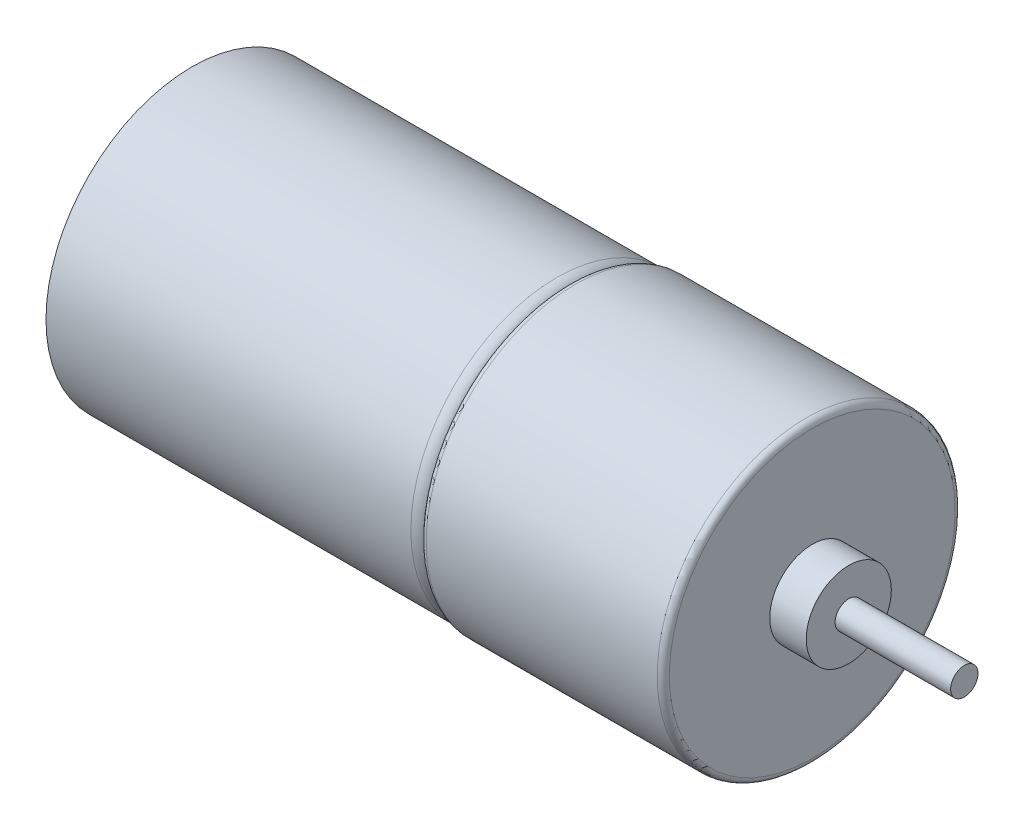
ISO-10303-21;
HEADER;
FILE_DESCRIPTION(('STEP AP214'),'2;1');
FILE_NAME('part.step','',(''),(''),'','','');
FILE_SCHEMA(('AUTOMOTIVE_DESIGN { 1 0 10303 214 1 1 1 1 }'));
ENDSEC;
DATA;
#1=APPLICATION_CONTEXT('core data for automotive mechanical design processes');
#2=APPLICATION_PROTOCOL_DEFINITION('international standard','automotive_design',2000,#1);
#3=PRODUCT_CONTEXT('',#1,'mechanical');
#4=PRODUCT('Part','Part','',(#3));
#5=PRODUCT_RELATED_PRODUCT_CATEGORY('part','',(#4));
#6=PRODUCT_DEFINITION_FORMATION('','',#4);
#7=PRODUCT_DEFINITION_CONTEXT('part definition',#1,'design');
#8=PRODUCT_DEFINITION('design','',#6,#7);
#9=PRODUCT_DEFINITION_SHAPE('','',#8);
#10=(LENGTH_UNIT() NAMED_UNIT(*) SI_UNIT(.MILLI.,.METRE.));
#11=(NAMED_UNIT(*) PLANE_ANGLE_UNIT() SI_UNIT($,.RADIAN.));
#12=(NAMED_UNIT(*) SI_UNIT($,.STERADIAN.) SOLID_ANGLE_UNIT());
#13=UNCERTAINTY_MEASURE_WITH_UNIT(LENGTH_MEASURE(1.E-05),#10,'distance_accuracy_value','');
#14=(GEOMETRIC_REPRESENTATION_CONTEXT(3) GLOBAL_UNCERTAINTY_ASSIGNED_CONTEXT((#13)) GLOBAL_UNIT_ASSIGNED_CONTEXT((#10,
#11,#12)) REPRESENTATION_CONTEXT('',''));
#15=CARTESIAN_POINT('',(0.,0.,0.));
#16=DIRECTION('',(0.,0.,1.));
#17=DIRECTION('',(1.,0.,0.));
#18=AXIS2_PLACEMENT_3D('',#15,#16,#17);
#19=CARTESIAN_POINT('',(54.,0.,0.));
#20=DIRECTION('',(1.,0.,0.));
#21=DIRECTION('',(0.,0.,-1.));
#22=AXIS2_PLACEMENT_3D('',#19,#20,#21);
#23=PLANE('',#22);
#24=CARTESIAN_POINT('',(54.,0.,0.));
#25=DIRECTION('',(1.,0.,0.));
#26=DIRECTION('',(0.,0.,-1.));
#27=AXIS2_PLACEMENT_3D('',#24,#25,#26);
#28=CIRCLE('',#27,3.5);
#29=CARTESIAN_POINT('',(54.,0.,-3.5));
#30=VERTEX_POINT('',#29);
#31=EDGE_CURVE('E65',#30,#30,#28,.T.);
#32=ORIENTED_EDGE('',*,*,#31,.T.);
#33=EDGE_LOOP('',(#32));
#34=FACE_BOUND('',#33,.T.);
#35=CARTESIAN_POINT('',(54.,0.,0.));
#36=DIRECTION('',(1.,0.,0.));
#37=DIRECTION('',(0.,0.,-1.));
#38=AXIS2_PLACEMENT_3D('',#35,#36,#37);
#39=CIRCLE('',#38,1.12551040235331);
#40=CARTESIAN_POINT('',(54.,0.,-1.12551040235331));
#41=VERTEX_POINT('',#40);
#42=EDGE_CURVE('E74',#41,#41,#39,.T.);
#43=ORIENTED_EDGE('',*,*,#42,.F.);
#44=EDGE_LOOP('',(#43));
#45=FACE_BOUND('',#44,.T.);
#46=ADVANCED_FACE('F32',(#34,#45),#23,.T.);
#47=CARTESIAN_POINT('',(51.,0.,0.));
#48=DIRECTION('',(1.,0.,0.));
#49=DIRECTION('',(0.,0.,-1.));
#50=AXIS2_PLACEMENT_3D('',#47,#48,#49);
#51=PLANE('',#50);
#52=CARTESIAN_POINT('',(51.,0.,0.));
#53=DIRECTION('',(1.,0.,0.));
#54=DIRECTION('',(0.,0.,-1.));
#55=AXIS2_PLACEMENT_3D('',#52,#53,#54);
#56=CIRCLE('',#55,11.75);
#57=CARTESIAN_POINT('',(51.,0.,-11.75));
#58=VERTEX_POINT('',#57);
#59=EDGE_CURVE('E10',#58,#58,#56,.T.);
#60=ORIENTED_EDGE('',*,*,#59,.T.);
#61=EDGE_LOOP('',(#60));
#62=FACE_BOUND('',#61,.T.);
#63=CARTESIAN_POINT('',(51.,0.,0.));
#64=DIRECTION('',(1.,0.,0.));
#65=DIRECTION('',(0.,0.,-1.));
#66=AXIS2_PLACEMENT_3D('',#63,#64,#65);
#67=CIRCLE('',#66,3.5);
#68=CARTESIAN_POINT('',(51.,0.,-3.5));
#69=VERTEX_POINT('',#68);
#70=EDGE_CURVE('E68',#69,#69,#67,.T.);
#71=ORIENTED_EDGE('',*,*,#70,.F.);
#72=EDGE_LOOP('',(#71));
#73=FACE_BOUND('',#72,.T.);
#74=ADVANCED_FACE('F90',(#62,#73),#51,.T.);
#75=CARTESIAN_POINT('',(31.,0.,0.));
#76=DIRECTION('',(-1.,0.,0.));
#77=DIRECTION('',(0.,0.,1.));
#78=AXIS2_PLACEMENT_3D('',#75,#76,#77);
#79=CYLINDRICAL_SURFACE('',#78,12.);
#80=CARTESIAN_POINT('',(30.,0.,0.));
#81=DIRECTION('',(1.,0.,0.));
#82=DIRECTION('',(0.,0.,-1.));
#83=AXIS2_PLACEMENT_3D('',#80,#81,#82);
#84=CIRCLE('',#83,12.);
#85=CARTESIAN_POINT('',(30.,0.,-12.));
#86=VERTEX_POINT('',#85);
#87=EDGE_CURVE('E52',#86,#86,#84,.F.);
#88=ORIENTED_EDGE('',*,*,#87,.T.);
#89=EDGE_LOOP('',(#88));
#90=FACE_BOUND('',#89,.T.);
#91=CARTESIAN_POINT('',(0.,0.,0.));
#92=DIRECTION('',(1.,0.,0.));
#93=DIRECTION('',(0.,0.,-1.));
#94=AXIS2_PLACEMENT_3D('',#91,#92,#93);
#95=CIRCLE('',#94,12.);
#96=CARTESIAN_POINT('',(0.,0.,-12.));
#97=VERTEX_POINT('',#96);
#98=EDGE_CURVE('E58',#97,#97,#95,.T.);
#99=ORIENTED_EDGE('',*,*,#98,.T.);
#100=EDGE_LOOP('',(#99));
#101=FACE_BOUND('',#100,.T.);
#102=ADVANCED_FACE('F96',(#90,#101),#79,.T.);
#103=CARTESIAN_POINT('',(0.,0.,0.));
#104=DIRECTION('',(1.,0.,0.));
#105=DIRECTION('',(0.,0.,-1.));
#106=AXIS2_PLACEMENT_3D('',#103,#104,#105);
#107=PLANE('',#106);
#108=CARTESIAN_POINT('',(0.,0.,0.));
#109=DIRECTION('',(-1.,0.,0.));
#110=DIRECTION('',(0.,0.,1.));
#111=AXIS2_PLACEMENT_3D('',#108,#109,#110);
#112=CIRCLE('',#111,11.5);
#113=CARTESIAN_POINT('',(0.,0.,11.5));
#114=VERTEX_POINT('',#113);
#115=EDGE_CURVE('E62',#114,#114,#112,.T.);
#116=ORIENTED_EDGE('',*,*,#115,.F.);
#117=EDGE_LOOP('',(#116));
#118=FACE_BOUND('',#117,.T.);
#119=ORIENTED_EDGE('',*,*,#98,.F.);
#120=EDGE_LOOP('',(#119));
#121=FACE_BOUND('',#120,.T.);
#122=ADVANCED_FACE('F120',(#118,#121),#107,.F.);
#123=CARTESIAN_POINT('',(30.,0.,0.));
#124=DIRECTION('',(1.,0.,0.));
#125=DIRECTION('',(0.,0.,-1.));
#126=AXIS2_PLACEMENT_3D('',#123,#124,#125);
#127=TOROIDAL_SURFACE('',#126,11.,1.);
#128=ORIENTED_EDGE('',*,*,#87,.F.);
#129=EDGE_LOOP('',(#128));
#130=FACE_BOUND('',#129,.T.);
#131=CARTESIAN_POINT('',(31.,0.,0.));
#132=DIRECTION('',(1.,0.,0.));
#133=DIRECTION('',(0.,0.,-1.));
#134=AXIS2_PLACEMENT_3D('',#131,#132,#133);
#135=CIRCLE('',#134,11.);
#136=CARTESIAN_POINT('',(31.,0.,-11.));
#137=VERTEX_POINT('',#136);
#138=EDGE_CURVE('E55',#137,#137,#135,.T.);
#139=ORIENTED_EDGE('',*,*,#138,.F.);
#140=EDGE_LOOP('',(#139));
#141=FACE_BOUND('',#140,.T.);
#142=ADVANCED_FACE('F118',(#130,#141),#127,.T.);
#143=CARTESIAN_POINT('',(1.,0.,0.));
#144=DIRECTION('',(-1.,0.,0.));
#145=DIRECTION('',(0.,0.,1.));
#146=AXIS2_PLACEMENT_3D('',#143,#144,#145);
#147=CYLINDRICAL_SURFACE('',#146,11.5);
#148=CARTESIAN_POINT('',(1.,0.,0.));
#149=DIRECTION('',(-1.,0.,0.));
#150=DIRECTION('',(0.,0.,1.));
#151=AXIS2_PLACEMENT_3D('',#148,#149,#150);
#152=CIRCLE('',#151,11.5);
#153=CARTESIAN_POINT('',(1.,0.,11.5));
#154=VERTEX_POINT('',#153);
#155=EDGE_CURVE('E61',#154,#154,#152,.T.);
#156=ORIENTED_EDGE('',*,*,#155,.F.);
#157=EDGE_LOOP('',(#156));
#158=FACE_BOUND('',#157,.T.);
#159=ORIENTED_EDGE('',*,*,#115,.T.);
#160=EDGE_LOOP('',(#159));
#161=FACE_BOUND('',#160,.T.);
#162=ADVANCED_FACE('F114',(#158,#161),#147,.F.);
#163=CARTESIAN_POINT('',(1.,0.,0.));
#164=DIRECTION('',(-1.,0.,0.));
#165=DIRECTION('',(0.,0.,1.));
#166=AXIS2_PLACEMENT_3D('',#163,#164,#165);
#167=PLANE('',#166);
#168=ORIENTED_EDGE('',*,*,#155,.T.);
#169=EDGE_LOOP('',(#168));
#170=FACE_BOUND('',#169,.T.);
#171=ADVANCED_FACE('F110',(#170),#167,.T.);
#172=CARTESIAN_POINT('',(51.,0.,0.));
#173=DIRECTION('',(-1.,0.,0.));
#174=DIRECTION('',(0.,0.,1.));
#175=AXIS2_PLACEMENT_3D('',#172,#173,#174);
#176=CYLINDRICAL_SURFACE('',#175,12.25);
#177=CARTESIAN_POINT('',(31.5,0.,0.));
#178=DIRECTION('',(1.,0.,0.));
#179=DIRECTION('',(0.,0.,-1.));
#180=AXIS2_PLACEMENT_3D('',#177,#178,#179);
#181=CIRCLE('',#180,12.25);
#182=CARTESIAN_POINT('',(31.5,0.,-12.25));
#183=VERTEX_POINT('',#182);
#184=EDGE_CURVE('E43',#183,#183,#181,.T.);
#185=ORIENTED_EDGE('',*,*,#184,.T.);
#186=EDGE_LOOP('',(#185));
#187=FACE_BOUND('',#186,.T.);
#188=CARTESIAN_POINT('',(50.5,0.,0.));
#189=DIRECTION('',(1.,0.,0.));
#190=DIRECTION('',(0.,0.,-1.));
#191=AXIS2_PLACEMENT_3D('',#188,#189,#190);
#192=CIRCLE('',#191,12.25);
#193=CARTESIAN_POINT('',(50.5,0.,-12.25));
#194=VERTEX_POINT('',#193);
#195=EDGE_CURVE('E47',#194,#194,#192,.F.);
#196=ORIENTED_EDGE('',*,*,#195,.T.);
#197=EDGE_LOOP('',(#196));
#198=FACE_BOUND('',#197,.T.);
#199=ADVANCED_FACE('F107',(#187,#198),#176,.T.);
#200=CARTESIAN_POINT('',(31.,0.,0.));
#201=DIRECTION('',(1.,0.,0.));
#202=DIRECTION('',(0.,0.,-1.));
#203=AXIS2_PLACEMENT_3D('',#200,#201,#202);
#204=PLANE('',#203);
#205=CARTESIAN_POINT('',(31.,0.,0.));
#206=DIRECTION('',(1.,0.,0.));
#207=DIRECTION('',(0.,0.,-1.));
#208=AXIS2_PLACEMENT_3D('',#205,#206,#207);
#209=CIRCLE('',#208,11.75);
#210=CARTESIAN_POINT('',(31.,0.,-11.75));
#211=VERTEX_POINT('',#210);
#212=EDGE_CURVE('E39',#211,#211,#209,.F.);
#213=ORIENTED_EDGE('',*,*,#212,.T.);
#214=EDGE_LOOP('',(#213));
#215=FACE_BOUND('',#214,.T.);
#216=ORIENTED_EDGE('',*,*,#138,.T.);
#217=EDGE_LOOP('',(#216));
#218=FACE_BOUND('',#217,.T.);
#219=ADVANCED_FACE('F103',(#215,#218),#204,.F.);
#220=CARTESIAN_POINT('',(31.5,0.,0.));
#221=DIRECTION('',(1.,0.,0.));
#222=DIRECTION('',(0.,0.,-1.));
#223=AXIS2_PLACEMENT_3D('',#220,#221,#222);
#224=TOROIDAL_SURFACE('',#223,11.75,0.5);
#225=ORIENTED_EDGE('',*,*,#212,.F.);
#226=EDGE_LOOP('',(#225));
#227=FACE_BOUND('',#226,.T.);
#228=ORIENTED_EDGE('',*,*,#184,.F.);
#229=EDGE_LOOP('',(#228));
#230=FACE_BOUND('',#229,.T.);
#231=ADVANCED_FACE('F106',(#227,#230),#224,.T.);
#232=CARTESIAN_POINT('',(50.5,0.,0.));
#233=DIRECTION('',(1.,0.,0.));
#234=DIRECTION('',(0.,0.,-1.));
#235=AXIS2_PLACEMENT_3D('',#232,#233,#234);
#236=TOROIDAL_SURFACE('',#235,11.75,0.5);
#237=ORIENTED_EDGE('',*,*,#195,.F.);
#238=EDGE_LOOP('',(#237));
#239=FACE_BOUND('',#238,.T.);
#240=ORIENTED_EDGE('',*,*,#59,.F.);
#241=EDGE_LOOP('',(#240));
#242=FACE_BOUND('',#241,.T.);
#243=ADVANCED_FACE('F34',(#239,#242),#236,.T.);
#244=CARTESIAN_POINT('',(54.,0.,0.));
#245=DIRECTION('',(-1.,0.,0.));
#246=DIRECTION('',(0.,0.,1.));
#247=AXIS2_PLACEMENT_3D('',#244,#245,#246);
#248=CYLINDRICAL_SURFACE('',#247,3.5);
#249=ORIENTED_EDGE('',*,*,#31,.F.);
#250=EDGE_LOOP('',(#249));
#251=FACE_BOUND('',#250,.T.);
#252=ORIENTED_EDGE('',*,*,#70,.T.);
#253=EDGE_LOOP('',(#252));
#254=FACE_BOUND('',#253,.T.);
#255=ADVANCED_FACE('F85',(#251,#254),#248,.T.);
#256=CARTESIAN_POINT('',(63.5,0.,0.));
#257=DIRECTION('',(-1.,0.,0.));
#258=DIRECTION('',(0.,0.,1.));
#259=AXIS2_PLACEMENT_3D('',#256,#257,#258);
#260=CYLINDRICAL_SURFACE('',#259,1.12551040235331);
#261=CARTESIAN_POINT('',(63.5,0.,0.));
#262=DIRECTION('',(1.,0.,0.));
#263=DIRECTION('',(0.,0.,-1.));
#264=AXIS2_PLACEMENT_3D('',#261,#262,#263);
#265=CIRCLE('',#264,1.12551040235331);
#266=CARTESIAN_POINT('',(63.5,0.,-1.12551040235331));
#267=VERTEX_POINT('',#266);
#268=EDGE_CURVE('E71',#267,#267,#265,.T.);
#269=ORIENTED_EDGE('',*,*,#268,.F.);
#270=EDGE_LOOP('',(#269));
#271=FACE_BOUND('',#270,.T.);
#272=ORIENTED_EDGE('',*,*,#42,.T.);
#273=EDGE_LOOP('',(#272));
#274=FACE_BOUND('',#273,.T.);
#275=ADVANCED_FACE('F82',(#271,#274),#260,.T.);
#276=CARTESIAN_POINT('',(63.5,0.,0.));
#277=DIRECTION('',(1.,0.,0.));
#278=DIRECTION('',(0.,0.,-1.));
#279=AXIS2_PLACEMENT_3D('',#276,#277,#278);
#280=PLANE('',#279);
#281=ORIENTED_EDGE('',*,*,#268,.T.);
#282=EDGE_LOOP('',(#281));
#283=FACE_BOUND('',#282,.T.);
#284=ADVANCED_FACE('F80',(#283),#280,.T.);
#285=CLOSED_SHELL('',(#46,#74,#102,#122,#142,#162,#171,#199,#219,#231,#243,#255,#275,#284));
#286=MANIFOLD_SOLID_BREP('B2',#285);
#287=ADVANCED_BREP_SHAPE_REPRESENTATION('',(#18,#286),#14);
#288=SHAPE_DEFINITION_REPRESENTATION(#9,#287);
ENDSEC;
END-ISO-10303-21;
